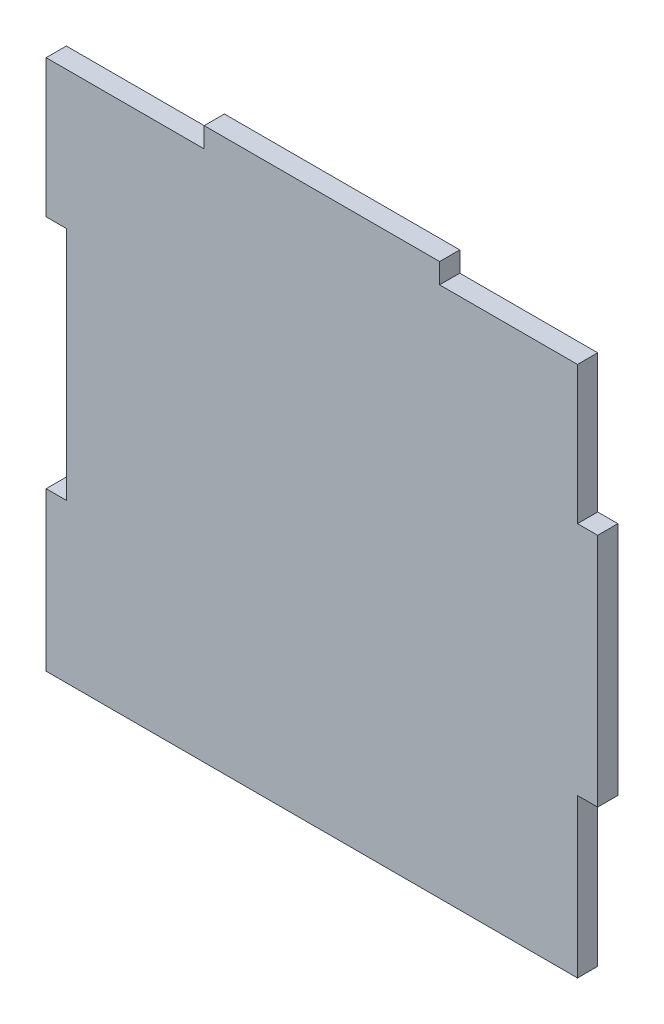
ISO-10303-21;
HEADER;
FILE_DESCRIPTION(('STEP AP214'),'2;1');
FILE_NAME('part.step','',(''),(''),'','','');
FILE_SCHEMA(('AUTOMOTIVE_DESIGN { 1 0 10303 214 1 1 1 1 }'));
ENDSEC;
DATA;
#1=APPLICATION_CONTEXT('core data for automotive mechanical design processes');
#2=APPLICATION_PROTOCOL_DEFINITION('international standard','automotive_design',2000,#1);
#3=PRODUCT_CONTEXT('',#1,'mechanical');
#4=PRODUCT('Part','Part','',(#3));
#5=PRODUCT_RELATED_PRODUCT_CATEGORY('part','',(#4));
#6=PRODUCT_DEFINITION_FORMATION('','',#4);
#7=PRODUCT_DEFINITION_CONTEXT('part definition',#1,'design');
#8=PRODUCT_DEFINITION('design','',#6,#7);
#9=PRODUCT_DEFINITION_SHAPE('','',#8);
#10=(LENGTH_UNIT() NAMED_UNIT(*) SI_UNIT(.MILLI.,.METRE.));
#11=(NAMED_UNIT(*) PLANE_ANGLE_UNIT() SI_UNIT($,.RADIAN.));
#12=(NAMED_UNIT(*) SI_UNIT($,.STERADIAN.) SOLID_ANGLE_UNIT());
#13=UNCERTAINTY_MEASURE_WITH_UNIT(LENGTH_MEASURE(1.E-05),#10,'distance_accuracy_value','');
#14=(GEOMETRIC_REPRESENTATION_CONTEXT(3) GLOBAL_UNCERTAINTY_ASSIGNED_CONTEXT((#13)) GLOBAL_UNIT_ASSIGNED_CONTEXT((#10,
#11,#12)) REPRESENTATION_CONTEXT('',''));
#15=CARTESIAN_POINT('',(0.,0.,0.));
#16=DIRECTION('',(0.,0.,1.));
#17=DIRECTION('',(1.,0.,0.));
#18=AXIS2_PLACEMENT_3D('',#15,#16,#17);
#19=CARTESIAN_POINT('',(38.,-16.,3.));
#20=DIRECTION('',(0.,1.,0.));
#21=DIRECTION('',(-1.,0.,0.));
#22=AXIS2_PLACEMENT_3D('',#19,#20,#21);
#23=PLANE('',#22);
#24=DIRECTION('',(1.,0.,0.));
#25=VECTOR('',#24,1.);
#26=CARTESIAN_POINT('',(38.,-16.,0.));
#27=LINE('',#26,#25);
#28=CARTESIAN_POINT('',(38.,-16.,0.));
#29=VERTEX_POINT('',#28);
#30=CARTESIAN_POINT('',(41.,-16.,0.));
#31=VERTEX_POINT('',#30);
#32=EDGE_CURVE('E188',#29,#31,#27,.T.);
#33=ORIENTED_EDGE('',*,*,#32,.T.);
#34=DIRECTION('',(0.,0.,-1.));
#35=VECTOR('',#34,1.);
#36=CARTESIAN_POINT('',(41.,-16.,3.));
#37=LINE('',#36,#35);
#38=CARTESIAN_POINT('',(41.,-16.,3.));
#39=VERTEX_POINT('',#38);
#40=EDGE_CURVE('E11',#39,#31,#37,.T.);
#41=ORIENTED_EDGE('',*,*,#40,.F.);
#42=DIRECTION('',(1.,0.,0.));
#43=VECTOR('',#42,1.);
#44=CARTESIAN_POINT('',(38.,-16.,3.));
#45=LINE('',#44,#43);
#46=CARTESIAN_POINT('',(38.,-16.,3.));
#47=VERTEX_POINT('',#46);
#48=EDGE_CURVE('E238',#47,#39,#45,.T.);
#49=ORIENTED_EDGE('',*,*,#48,.F.);
#50=DIRECTION('',(0.,0.,-1.));
#51=VECTOR('',#50,1.);
#52=CARTESIAN_POINT('',(38.,-16.,3.));
#53=LINE('',#52,#51);
#54=EDGE_CURVE('E184',#47,#29,#53,.T.);
#55=ORIENTED_EDGE('',*,*,#54,.T.);
#56=EDGE_LOOP('',(#33,#41,#49,#55));
#57=FACE_BOUND('',#56,.T.);
#58=ADVANCED_FACE('F39',(#57),#23,.F.);
#59=CARTESIAN_POINT('',(41.,16.,3.));
#60=DIRECTION('',(-1.,0.,0.));
#61=DIRECTION('',(0.,0.,1.));
#62=AXIS2_PLACEMENT_3D('',#59,#60,#61);
#63=PLANE('',#62);
#64=DIRECTION('',(0.,1.,0.));
#65=VECTOR('',#64,1.);
#66=CARTESIAN_POINT('',(41.,16.,0.));
#67=LINE('',#66,#65);
#68=CARTESIAN_POINT('',(41.,19.,0.));
#69=VERTEX_POINT('',#68);
#70=EDGE_CURVE('E192',#31,#69,#67,.T.);
#71=ORIENTED_EDGE('',*,*,#70,.T.);
#72=DIRECTION('',(0.,0.,-1.));
#73=VECTOR('',#72,1.);
#74=CARTESIAN_POINT('',(41.,19.,3.));
#75=LINE('',#74,#73);
#76=CARTESIAN_POINT('',(41.,19.,3.));
#77=VERTEX_POINT('',#76);
#78=EDGE_CURVE('E48',#77,#69,#75,.T.);
#79=ORIENTED_EDGE('',*,*,#78,.F.);
#80=DIRECTION('',(0.,1.,0.));
#81=VECTOR('',#80,1.);
#82=CARTESIAN_POINT('',(41.,16.,3.));
#83=LINE('',#82,#81);
#84=EDGE_CURVE('E121',#39,#77,#83,.T.);
#85=ORIENTED_EDGE('',*,*,#84,.F.);
#86=ORIENTED_EDGE('',*,*,#40,.T.);
#87=EDGE_LOOP('',(#71,#79,#85,#86));
#88=FACE_BOUND('',#87,.T.);
#89=ADVANCED_FACE('F353',(#88),#63,.F.);
#90=CARTESIAN_POINT('',(41.,19.,3.));
#91=DIRECTION('',(0.,-1.,0.));
#92=DIRECTION('',(0.,0.,-1.));
#93=AXIS2_PLACEMENT_3D('',#90,#91,#92);
#94=PLANE('',#93);
#95=DIRECTION('',(-1.,0.,0.));
#96=VECTOR('',#95,1.);
#97=CARTESIAN_POINT('',(41.,19.,0.));
#98=LINE('',#97,#96);
#99=CARTESIAN_POINT('',(38.,19.,0.));
#100=VERTEX_POINT('',#99);
#101=EDGE_CURVE('E195',#69,#100,#98,.T.);
#102=ORIENTED_EDGE('',*,*,#101,.T.);
#103=DIRECTION('',(0.,0.,-1.));
#104=VECTOR('',#103,1.);
#105=CARTESIAN_POINT('',(38.,19.,3.));
#106=LINE('',#105,#104);
#107=CARTESIAN_POINT('',(38.,19.,3.));
#108=VERTEX_POINT('',#107);
#109=EDGE_CURVE('E281',#108,#100,#106,.T.);
#110=ORIENTED_EDGE('',*,*,#109,.F.);
#111=DIRECTION('',(-1.,0.,0.));
#112=VECTOR('',#111,1.);
#113=CARTESIAN_POINT('',(41.,19.,3.));
#114=LINE('',#113,#112);
#115=EDGE_CURVE('E291',#77,#108,#114,.T.);
#116=ORIENTED_EDGE('',*,*,#115,.F.);
#117=ORIENTED_EDGE('',*,*,#78,.T.);
#118=EDGE_LOOP('',(#102,#110,#116,#117));
#119=FACE_BOUND('',#118,.T.);
#120=ADVANCED_FACE('F289',(#119),#94,.F.);
#121=CARTESIAN_POINT('',(38.,39.5,3.));
#122=DIRECTION('',(-1.,0.,0.));
#123=DIRECTION('',(0.,-1.,0.));
#124=AXIS2_PLACEMENT_3D('',#121,#122,#123);
#125=PLANE('',#124);
#126=DIRECTION('',(0.,1.,0.));
#127=VECTOR('',#126,1.);
#128=CARTESIAN_POINT('',(38.,39.5,0.));
#129=LINE('',#128,#127);
#130=CARTESIAN_POINT('',(38.,39.5,0.));
#131=VERTEX_POINT('',#130);
#132=EDGE_CURVE('E198',#100,#131,#129,.T.);
#133=ORIENTED_EDGE('',*,*,#132,.T.);
#134=DIRECTION('',(0.,0.,-1.));
#135=VECTOR('',#134,1.);
#136=CARTESIAN_POINT('',(38.,39.5,3.));
#137=LINE('',#136,#135);
#138=CARTESIAN_POINT('',(38.,39.5,3.));
#139=VERTEX_POINT('',#138);
#140=EDGE_CURVE('E277',#139,#131,#137,.T.);
#141=ORIENTED_EDGE('',*,*,#140,.F.);
#142=DIRECTION('',(0.,1.,0.));
#143=VECTOR('',#142,1.);
#144=CARTESIAN_POINT('',(38.,39.5,3.));
#145=LINE('',#144,#143);
#146=EDGE_CURVE('E308',#108,#139,#145,.T.);
#147=ORIENTED_EDGE('',*,*,#146,.F.);
#148=ORIENTED_EDGE('',*,*,#109,.T.);
#149=EDGE_LOOP('',(#133,#141,#147,#148));
#150=FACE_BOUND('',#149,.T.);
#151=ADVANCED_FACE('F298',(#150),#125,.F.);
#152=CARTESIAN_POINT('',(17.5,39.5,3.));
#153=DIRECTION('',(0.,-1.,0.));
#154=DIRECTION('',(1.,0.,0.));
#155=AXIS2_PLACEMENT_3D('',#152,#153,#154);
#156=PLANE('',#155);
#157=DIRECTION('',(-1.,0.,0.));
#158=VECTOR('',#157,1.);
#159=CARTESIAN_POINT('',(17.5,39.5,0.));
#160=LINE('',#159,#158);
#161=CARTESIAN_POINT('',(17.5,39.5,0.));
#162=VERTEX_POINT('',#161);
#163=EDGE_CURVE('E201',#131,#162,#160,.T.);
#164=ORIENTED_EDGE('',*,*,#163,.T.);
#165=DIRECTION('',(0.,0.,-1.));
#166=VECTOR('',#165,1.);
#167=CARTESIAN_POINT('',(17.5,39.5,3.));
#168=LINE('',#167,#166);
#169=CARTESIAN_POINT('',(17.5,39.5,3.));
#170=VERTEX_POINT('',#169);
#171=EDGE_CURVE('E273',#170,#162,#168,.T.);
#172=ORIENTED_EDGE('',*,*,#171,.F.);
#173=DIRECTION('',(-1.,0.,0.));
#174=VECTOR('',#173,1.);
#175=CARTESIAN_POINT('',(17.5,39.5,3.));
#176=LINE('',#175,#174);
#177=EDGE_CURVE('E304',#139,#170,#176,.T.);
#178=ORIENTED_EDGE('',*,*,#177,.F.);
#179=ORIENTED_EDGE('',*,*,#140,.T.);
#180=EDGE_LOOP('',(#164,#172,#178,#179));
#181=FACE_BOUND('',#180,.T.);
#182=ADVANCED_FACE('F302',(#181),#156,.F.);
#183=CARTESIAN_POINT('',(17.5,42.5,3.));
#184=DIRECTION('',(-1.,0.,0.));
#185=DIRECTION('',(0.,-1.,0.));
#186=AXIS2_PLACEMENT_3D('',#183,#184,#185);
#187=PLANE('',#186);
#188=DIRECTION('',(0.,1.,0.));
#189=VECTOR('',#188,1.);
#190=CARTESIAN_POINT('',(17.5,42.5,0.));
#191=LINE('',#190,#189);
#192=CARTESIAN_POINT('',(17.5,42.5,0.));
#193=VERTEX_POINT('',#192);
#194=EDGE_CURVE('E204',#162,#193,#191,.T.);
#195=ORIENTED_EDGE('',*,*,#194,.T.);
#196=DIRECTION('',(0.,0.,-1.));
#197=VECTOR('',#196,1.);
#198=CARTESIAN_POINT('',(17.5,42.5,3.));
#199=LINE('',#198,#197);
#200=CARTESIAN_POINT('',(17.5,42.5,3.));
#201=VERTEX_POINT('',#200);
#202=EDGE_CURVE('E269',#201,#193,#199,.T.);
#203=ORIENTED_EDGE('',*,*,#202,.F.);
#204=DIRECTION('',(0.,1.,0.));
#205=VECTOR('',#204,1.);
#206=CARTESIAN_POINT('',(17.5,42.5,3.));
#207=LINE('',#206,#205);
#208=EDGE_CURVE('E307',#170,#201,#207,.T.);
#209=ORIENTED_EDGE('',*,*,#208,.F.);
#210=ORIENTED_EDGE('',*,*,#171,.T.);
#211=EDGE_LOOP('',(#195,#203,#209,#210));
#212=FACE_BOUND('',#211,.T.);
#213=ADVANCED_FACE('F365',(#212),#187,.F.);
#214=CARTESIAN_POINT('',(-17.5,42.5,3.));
#215=DIRECTION('',(0.,-1.,0.));
#216=DIRECTION('',(0.,0.,-1.));
#217=AXIS2_PLACEMENT_3D('',#214,#215,#216);
#218=PLANE('',#217);
#219=DIRECTION('',(-1.,0.,0.));
#220=VECTOR('',#219,1.);
#221=CARTESIAN_POINT('',(-17.5,42.5,0.));
#222=LINE('',#221,#220);
#223=CARTESIAN_POINT('',(-17.5,42.5,0.));
#224=VERTEX_POINT('',#223);
#225=EDGE_CURVE('E207',#193,#224,#222,.T.);
#226=ORIENTED_EDGE('',*,*,#225,.T.);
#227=DIRECTION('',(0.,0.,-1.));
#228=VECTOR('',#227,1.);
#229=CARTESIAN_POINT('',(-17.5,42.5,3.));
#230=LINE('',#229,#228);
#231=CARTESIAN_POINT('',(-17.5,42.5,3.));
#232=VERTEX_POINT('',#231);
#233=EDGE_CURVE('E265',#232,#224,#230,.T.);
#234=ORIENTED_EDGE('',*,*,#233,.F.);
#235=DIRECTION('',(-1.,0.,0.));
#236=VECTOR('',#235,1.);
#237=CARTESIAN_POINT('',(-17.5,42.5,3.));
#238=LINE('',#237,#236);
#239=EDGE_CURVE('E312',#201,#232,#238,.T.);
#240=ORIENTED_EDGE('',*,*,#239,.F.);
#241=ORIENTED_EDGE('',*,*,#202,.T.);
#242=EDGE_LOOP('',(#226,#234,#240,#241));
#243=FACE_BOUND('',#242,.T.);
#244=ADVANCED_FACE('F368',(#243),#218,.F.);
#245=CARTESIAN_POINT('',(-17.5,39.5,3.));
#246=DIRECTION('',(1.,0.,0.));
#247=DIRECTION('',(0.,0.,-1.));
#248=AXIS2_PLACEMENT_3D('',#245,#246,#247);
#249=PLANE('',#248);
#250=DIRECTION('',(0.,-1.,0.));
#251=VECTOR('',#250,1.);
#252=CARTESIAN_POINT('',(-17.5,39.5,0.));
#253=LINE('',#252,#251);
#254=CARTESIAN_POINT('',(-17.5,39.5,0.));
#255=VERTEX_POINT('',#254);
#256=EDGE_CURVE('E210',#224,#255,#253,.T.);
#257=ORIENTED_EDGE('',*,*,#256,.T.);
#258=DIRECTION('',(0.,0.,-1.));
#259=VECTOR('',#258,1.);
#260=CARTESIAN_POINT('',(-17.5,39.5,3.));
#261=LINE('',#260,#259);
#262=CARTESIAN_POINT('',(-17.5,39.5,3.));
#263=VERTEX_POINT('',#262);
#264=EDGE_CURVE('E261',#263,#255,#261,.T.);
#265=ORIENTED_EDGE('',*,*,#264,.F.);
#266=DIRECTION('',(0.,-1.,0.));
#267=VECTOR('',#266,1.);
#268=CARTESIAN_POINT('',(-17.5,39.5,3.));
#269=LINE('',#268,#267);
#270=EDGE_CURVE('E319',#232,#263,#269,.T.);
#271=ORIENTED_EDGE('',*,*,#270,.F.);
#272=ORIENTED_EDGE('',*,*,#233,.T.);
#273=EDGE_LOOP('',(#257,#265,#271,#272));
#274=FACE_BOUND('',#273,.T.);
#275=ADVANCED_FACE('F372',(#274),#249,.F.);
#276=CARTESIAN_POINT('',(-41.,39.5,3.));
#277=DIRECTION('',(0.,-1.,0.));
#278=DIRECTION('',(0.,0.,-1.));
#279=AXIS2_PLACEMENT_3D('',#276,#277,#278);
#280=PLANE('',#279);
#281=DIRECTION('',(-1.,0.,0.));
#282=VECTOR('',#281,1.);
#283=CARTESIAN_POINT('',(-41.,39.5,0.));
#284=LINE('',#283,#282);
#285=CARTESIAN_POINT('',(-41.,39.5,0.));
#286=VERTEX_POINT('',#285);
#287=EDGE_CURVE('E214',#255,#286,#284,.T.);
#288=ORIENTED_EDGE('',*,*,#287,.T.);
#289=DIRECTION('',(0.,0.,-1.));
#290=VECTOR('',#289,1.);
#291=CARTESIAN_POINT('',(-41.,39.5,3.));
#292=LINE('',#291,#290);
#293=CARTESIAN_POINT('',(-41.,39.5,3.));
#294=VERTEX_POINT('',#293);
#295=EDGE_CURVE('E257',#294,#286,#292,.T.);
#296=ORIENTED_EDGE('',*,*,#295,.F.);
#297=DIRECTION('',(-1.,0.,0.));
#298=VECTOR('',#297,1.);
#299=CARTESIAN_POINT('',(-38.,39.5,3.));
#300=LINE('',#299,#298);
#301=EDGE_CURVE('E322',#263,#294,#300,.T.);
#302=ORIENTED_EDGE('',*,*,#301,.F.);
#303=ORIENTED_EDGE('',*,*,#264,.T.);
#304=EDGE_LOOP('',(#288,#296,#302,#303));
#305=FACE_BOUND('',#304,.T.);
#306=ADVANCED_FACE('F376',(#305),#280,.F.);
#307=CARTESIAN_POINT('',(-41.,19.,3.));
#308=DIRECTION('',(1.,0.,0.));
#309=DIRECTION('',(0.,1.,0.));
#310=AXIS2_PLACEMENT_3D('',#307,#308,#309);
#311=PLANE('',#310);
#312=DIRECTION('',(0.,-1.,0.));
#313=VECTOR('',#312,1.);
#314=CARTESIAN_POINT('',(-41.,19.,0.));
#315=LINE('',#314,#313);
#316=CARTESIAN_POINT('',(-41.,19.,0.));
#317=VERTEX_POINT('',#316);
#318=EDGE_CURVE('E217',#286,#317,#315,.T.);
#319=ORIENTED_EDGE('',*,*,#318,.T.);
#320=DIRECTION('',(0.,0.,-1.));
#321=VECTOR('',#320,1.);
#322=CARTESIAN_POINT('',(-41.,19.,3.));
#323=LINE('',#322,#321);
#324=CARTESIAN_POINT('',(-41.,19.,3.));
#325=VERTEX_POINT('',#324);
#326=EDGE_CURVE('E253',#325,#317,#323,.T.);
#327=ORIENTED_EDGE('',*,*,#326,.F.);
#328=DIRECTION('',(0.,-1.,0.));
#329=VECTOR('',#328,1.);
#330=CARTESIAN_POINT('',(-41.,19.,3.));
#331=LINE('',#330,#329);
#332=EDGE_CURVE('E325',#294,#325,#331,.T.);
#333=ORIENTED_EDGE('',*,*,#332,.F.);
#334=ORIENTED_EDGE('',*,*,#295,.T.);
#335=EDGE_LOOP('',(#319,#327,#333,#334));
#336=FACE_BOUND('',#335,.T.);
#337=ADVANCED_FACE('F380',(#336),#311,.F.);
#338=CARTESIAN_POINT('',(-38.,19.,3.));
#339=DIRECTION('',(0.,1.,0.));
#340=DIRECTION('',(-1.,0.,0.));
#341=AXIS2_PLACEMENT_3D('',#338,#339,#340);
#342=PLANE('',#341);
#343=DIRECTION('',(1.,0.,0.));
#344=VECTOR('',#343,1.);
#345=CARTESIAN_POINT('',(-38.,19.,0.));
#346=LINE('',#345,#344);
#347=CARTESIAN_POINT('',(-38.,19.,0.));
#348=VERTEX_POINT('',#347);
#349=EDGE_CURVE('E220',#317,#348,#346,.T.);
#350=ORIENTED_EDGE('',*,*,#349,.T.);
#351=DIRECTION('',(0.,0.,-1.));
#352=VECTOR('',#351,1.);
#353=CARTESIAN_POINT('',(-38.,19.,3.));
#354=LINE('',#353,#352);
#355=CARTESIAN_POINT('',(-38.,19.,3.));
#356=VERTEX_POINT('',#355);
#357=EDGE_CURVE('E249',#356,#348,#354,.T.);
#358=ORIENTED_EDGE('',*,*,#357,.F.);
#359=DIRECTION('',(1.,0.,0.));
#360=VECTOR('',#359,1.);
#361=CARTESIAN_POINT('',(-38.,19.,3.));
#362=LINE('',#361,#360);
#363=EDGE_CURVE('E328',#325,#356,#362,.T.);
#364=ORIENTED_EDGE('',*,*,#363,.F.);
#365=ORIENTED_EDGE('',*,*,#326,.T.);
#366=EDGE_LOOP('',(#350,#358,#364,#365));
#367=FACE_BOUND('',#366,.T.);
#368=ADVANCED_FACE('F384',(#367),#342,.F.);
#369=CARTESIAN_POINT('',(-38.,16.,3.));
#370=DIRECTION('',(1.,0.,0.));
#371=DIRECTION('',(0.,0.,-1.));
#372=AXIS2_PLACEMENT_3D('',#369,#370,#371);
#373=PLANE('',#372);
#374=DIRECTION('',(0.,-1.,0.));
#375=VECTOR('',#374,1.);
#376=CARTESIAN_POINT('',(-38.,16.,0.));
#377=LINE('',#376,#375);
#378=CARTESIAN_POINT('',(-38.,-16.,0.));
#379=VERTEX_POINT('',#378);
#380=EDGE_CURVE('E224',#348,#379,#377,.T.);
#381=ORIENTED_EDGE('',*,*,#380,.T.);
#382=DIRECTION('',(0.,0.,-1.));
#383=VECTOR('',#382,1.);
#384=CARTESIAN_POINT('',(-38.,-16.,3.));
#385=LINE('',#384,#383);
#386=CARTESIAN_POINT('',(-38.,-16.,3.));
#387=VERTEX_POINT('',#386);
#388=EDGE_CURVE('E245',#387,#379,#385,.T.);
#389=ORIENTED_EDGE('',*,*,#388,.F.);
#390=DIRECTION('',(0.,-1.,0.));
#391=VECTOR('',#390,1.);
#392=CARTESIAN_POINT('',(-38.,16.,3.));
#393=LINE('',#392,#391);
#394=EDGE_CURVE('E331',#356,#387,#393,.T.);
#395=ORIENTED_EDGE('',*,*,#394,.F.);
#396=ORIENTED_EDGE('',*,*,#357,.T.);
#397=EDGE_LOOP('',(#381,#389,#395,#396));
#398=FACE_BOUND('',#397,.T.);
#399=ADVANCED_FACE('F339',(#398),#373,.F.);
#400=CARTESIAN_POINT('',(-41.,-16.,3.));
#401=DIRECTION('',(0.,-1.,0.));
#402=DIRECTION('',(0.,0.,-1.));
#403=AXIS2_PLACEMENT_3D('',#400,#401,#402);
#404=PLANE('',#403);
#405=DIRECTION('',(-1.,0.,0.));
#406=VECTOR('',#405,1.);
#407=CARTESIAN_POINT('',(-41.,-16.,0.));
#408=LINE('',#407,#406);
#409=CARTESIAN_POINT('',(-41.,-16.,0.));
#410=VERTEX_POINT('',#409);
#411=EDGE_CURVE('E227',#379,#410,#408,.T.);
#412=ORIENTED_EDGE('',*,*,#411,.T.);
#413=DIRECTION('',(0.,0.,-1.));
#414=VECTOR('',#413,1.);
#415=CARTESIAN_POINT('',(-41.,-16.,3.));
#416=LINE('',#415,#414);
#417=CARTESIAN_POINT('',(-41.,-16.,3.));
#418=VERTEX_POINT('',#417);
#419=EDGE_CURVE('E177',#418,#410,#416,.T.);
#420=ORIENTED_EDGE('',*,*,#419,.F.);
#421=DIRECTION('',(-1.,0.,0.));
#422=VECTOR('',#421,1.);
#423=CARTESIAN_POINT('',(-41.,-16.,3.));
#424=LINE('',#423,#422);
#425=EDGE_CURVE('E165',#387,#418,#424,.T.);
#426=ORIENTED_EDGE('',*,*,#425,.F.);
#427=ORIENTED_EDGE('',*,*,#388,.T.);
#428=EDGE_LOOP('',(#412,#420,#426,#427));
#429=FACE_BOUND('',#428,.T.);
#430=ADVANCED_FACE('F342',(#429),#404,.F.);
#431=CARTESIAN_POINT('',(-41.,-19.,3.));
#432=DIRECTION('',(1.,0.,0.));
#433=DIRECTION('',(0.,1.,0.));
#434=AXIS2_PLACEMENT_3D('',#431,#432,#433);
#435=PLANE('',#434);
#436=DIRECTION('',(0.,-1.,0.));
#437=VECTOR('',#436,1.);
#438=CARTESIAN_POINT('',(-41.,-19.,0.));
#439=LINE('',#438,#437);
#440=CARTESIAN_POINT('',(-41.,-39.5,0.));
#441=VERTEX_POINT('',#440);
#442=EDGE_CURVE('E174',#410,#441,#439,.T.);
#443=ORIENTED_EDGE('',*,*,#442,.T.);
#444=DIRECTION('',(0.,0.,-1.));
#445=VECTOR('',#444,1.);
#446=CARTESIAN_POINT('',(-41.,-39.5,3.));
#447=LINE('',#446,#445);
#448=CARTESIAN_POINT('',(-41.,-39.5,3.));
#449=VERTEX_POINT('',#448);
#450=EDGE_CURVE('E172',#449,#441,#447,.T.);
#451=ORIENTED_EDGE('',*,*,#450,.F.);
#452=DIRECTION('',(0.,-1.,0.));
#453=VECTOR('',#452,1.);
#454=CARTESIAN_POINT('',(-41.,-19.,3.));
#455=LINE('',#454,#453);
#456=EDGE_CURVE('E158',#418,#449,#455,.T.);
#457=ORIENTED_EDGE('',*,*,#456,.F.);
#458=ORIENTED_EDGE('',*,*,#419,.T.);
#459=EDGE_LOOP('',(#443,#451,#457,#458));
#460=FACE_BOUND('',#459,.T.);
#461=ADVANCED_FACE('F173',(#460),#435,.F.);
#462=CARTESIAN_POINT('',(-41.,-39.5,3.));
#463=DIRECTION('',(0.,1.,0.));
#464=DIRECTION('',(0.,0.,1.));
#465=AXIS2_PLACEMENT_3D('',#462,#463,#464);
#466=PLANE('',#465);
#467=DIRECTION('',(1.,0.,0.));
#468=VECTOR('',#467,1.);
#469=CARTESIAN_POINT('',(-41.,-39.5,0.));
#470=LINE('',#469,#468);
#471=CARTESIAN_POINT('',(38.,-39.5,0.));
#472=VERTEX_POINT('',#471);
#473=EDGE_CURVE('E233',#441,#472,#470,.T.);
#474=ORIENTED_EDGE('',*,*,#473,.T.);
#475=DIRECTION('',(0.,0.,-1.));
#476=VECTOR('',#475,1.);
#477=CARTESIAN_POINT('',(38.,-39.5,3.));
#478=LINE('',#477,#476);
#479=CARTESIAN_POINT('',(38.,-39.5,3.));
#480=VERTEX_POINT('',#479);
#481=EDGE_CURVE('E178',#480,#472,#478,.T.);
#482=ORIENTED_EDGE('',*,*,#481,.F.);
#483=DIRECTION('',(1.,0.,0.));
#484=VECTOR('',#483,1.);
#485=CARTESIAN_POINT('',(-41.,-39.5,3.));
#486=LINE('',#485,#484);
#487=EDGE_CURVE('E162',#449,#480,#486,.T.);
#488=ORIENTED_EDGE('',*,*,#487,.F.);
#489=ORIENTED_EDGE('',*,*,#450,.T.);
#490=EDGE_LOOP('',(#474,#482,#488,#489));
#491=FACE_BOUND('',#490,.T.);
#492=ADVANCED_FACE('F180',(#491),#466,.F.);
#493=CARTESIAN_POINT('',(38.,-19.,3.));
#494=DIRECTION('',(-1.,0.,0.));
#495=DIRECTION('',(0.,-1.,0.));
#496=AXIS2_PLACEMENT_3D('',#493,#494,#495);
#497=PLANE('',#496);
#498=DIRECTION('',(0.,1.,0.));
#499=VECTOR('',#498,1.);
#500=CARTESIAN_POINT('',(38.,-19.,0.));
#501=LINE('',#500,#499);
#502=EDGE_CURVE('E109',#472,#29,#501,.T.);
#503=ORIENTED_EDGE('',*,*,#502,.T.);
#504=ORIENTED_EDGE('',*,*,#54,.F.);
#505=DIRECTION('',(0.,1.,0.));
#506=VECTOR('',#505,1.);
#507=CARTESIAN_POINT('',(38.,-19.,3.));
#508=LINE('',#507,#506);
#509=EDGE_CURVE('E56',#480,#47,#508,.T.);
#510=ORIENTED_EDGE('',*,*,#509,.F.);
#511=ORIENTED_EDGE('',*,*,#481,.T.);
#512=EDGE_LOOP('',(#503,#504,#510,#511));
#513=FACE_BOUND('',#512,.T.);
#514=ADVANCED_FACE('F344',(#513),#497,.F.);
#515=CARTESIAN_POINT('',(0.,0.,3.));
#516=DIRECTION('',(0.,0.,-1.));
#517=DIRECTION('',(-1.,0.,0.));
#518=AXIS2_PLACEMENT_3D('',#515,#516,#517);
#519=PLANE('',#518);
#520=ORIENTED_EDGE('',*,*,#48,.T.);
#521=ORIENTED_EDGE('',*,*,#84,.T.);
#522=ORIENTED_EDGE('',*,*,#115,.T.);
#523=ORIENTED_EDGE('',*,*,#146,.T.);
#524=ORIENTED_EDGE('',*,*,#177,.T.);
#525=ORIENTED_EDGE('',*,*,#208,.T.);
#526=ORIENTED_EDGE('',*,*,#239,.T.);
#527=ORIENTED_EDGE('',*,*,#270,.T.);
#528=ORIENTED_EDGE('',*,*,#301,.T.);
#529=ORIENTED_EDGE('',*,*,#332,.T.);
#530=ORIENTED_EDGE('',*,*,#363,.T.);
#531=ORIENTED_EDGE('',*,*,#394,.T.);
#532=ORIENTED_EDGE('',*,*,#425,.T.);
#533=ORIENTED_EDGE('',*,*,#456,.T.);
#534=ORIENTED_EDGE('',*,*,#487,.T.);
#535=ORIENTED_EDGE('',*,*,#509,.T.);
#536=EDGE_LOOP('',(#520,#521,#522,#523,#524,#525,#526,#527,#528,#529,#530,#531,#532,#533,#534,#535));
#537=FACE_BOUND('',#536,.T.);
#538=ADVANCED_FACE('F160',(#537),#519,.F.);
#539=CARTESIAN_POINT('',(0.,0.,0.));
#540=DIRECTION('',(0.,0.,-1.));
#541=DIRECTION('',(-1.,0.,0.));
#542=AXIS2_PLACEMENT_3D('',#539,#540,#541);
#543=PLANE('',#542);
#544=ORIENTED_EDGE('',*,*,#32,.F.);
#545=ORIENTED_EDGE('',*,*,#502,.F.);
#546=ORIENTED_EDGE('',*,*,#473,.F.);
#547=ORIENTED_EDGE('',*,*,#442,.F.);
#548=ORIENTED_EDGE('',*,*,#411,.F.);
#549=ORIENTED_EDGE('',*,*,#380,.F.);
#550=ORIENTED_EDGE('',*,*,#349,.F.);
#551=ORIENTED_EDGE('',*,*,#318,.F.);
#552=ORIENTED_EDGE('',*,*,#287,.F.);
#553=ORIENTED_EDGE('',*,*,#256,.F.);
#554=ORIENTED_EDGE('',*,*,#225,.F.);
#555=ORIENTED_EDGE('',*,*,#194,.F.);
#556=ORIENTED_EDGE('',*,*,#163,.F.);
#557=ORIENTED_EDGE('',*,*,#132,.F.);
#558=ORIENTED_EDGE('',*,*,#101,.F.);
#559=ORIENTED_EDGE('',*,*,#70,.F.);
#560=EDGE_LOOP('',(#544,#545,#546,#547,#548,#549,#550,#551,#552,#553,#554,#555,#556,#557,#558,#559));
#561=FACE_BOUND('',#560,.T.);
#562=ADVANCED_FACE('F293',(#561),#543,.T.);
#563=CLOSED_SHELL('',(#58,#89,#120,#151,#182,#213,#244,#275,#306,#337,#368,#399,#430,#461,#492,
#514,#538,#562));
#564=MANIFOLD_SOLID_BREP('B2',#563);
#565=ADVANCED_BREP_SHAPE_REPRESENTATION('',(#18,#564),#14);
#566=SHAPE_DEFINITION_REPRESENTATION(#9,#565);
ENDSEC;
END-ISO-10303-21;
